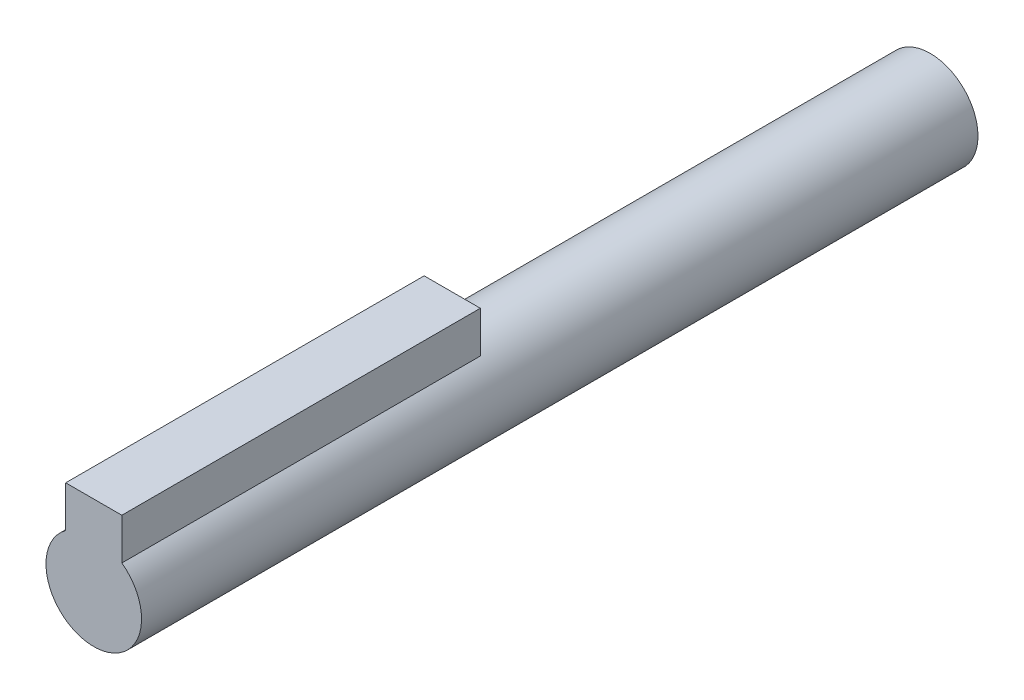
ISO-10303-21;
HEADER;
FILE_DESCRIPTION(('STEP AP214'),'2;1');
FILE_NAME('part.step','',(''),(''),'','','');
FILE_SCHEMA(('AUTOMOTIVE_DESIGN { 1 0 10303 214 1 1 1 1 }'));
ENDSEC;
DATA;
#1=APPLICATION_CONTEXT('core data for automotive mechanical design processes');
#2=APPLICATION_PROTOCOL_DEFINITION('international standard','automotive_design',2000,#1);
#3=PRODUCT_CONTEXT('',#1,'mechanical');
#4=PRODUCT('Part','Part','',(#3));
#5=PRODUCT_RELATED_PRODUCT_CATEGORY('part','',(#4));
#6=PRODUCT_DEFINITION_FORMATION('','',#4);
#7=PRODUCT_DEFINITION_CONTEXT('part definition',#1,'design');
#8=PRODUCT_DEFINITION('design','',#6,#7);
#9=PRODUCT_DEFINITION_SHAPE('','',#8);
#10=(LENGTH_UNIT() NAMED_UNIT(*) SI_UNIT(.MILLI.,.METRE.));
#11=(NAMED_UNIT(*) PLANE_ANGLE_UNIT() SI_UNIT($,.RADIAN.));
#12=(NAMED_UNIT(*) SI_UNIT($,.STERADIAN.) SOLID_ANGLE_UNIT());
#13=UNCERTAINTY_MEASURE_WITH_UNIT(LENGTH_MEASURE(1.E-05),#10,'distance_accuracy_value','');
#14=(GEOMETRIC_REPRESENTATION_CONTEXT(3) GLOBAL_UNCERTAINTY_ASSIGNED_CONTEXT((#13)) GLOBAL_UNIT_ASSIGNED_CONTEXT((#10,
#11,#12)) REPRESENTATION_CONTEXT('',''));
#15=CARTESIAN_POINT('',(0.,0.,0.));
#16=DIRECTION('',(0.,0.,1.));
#17=DIRECTION('',(1.,0.,0.));
#18=AXIS2_PLACEMENT_3D('',#15,#16,#17);
#19=CARTESIAN_POINT('',(0.,0.,70.));
#20=DIRECTION('',(0.,0.,-1.));
#21=DIRECTION('',(-1.,0.,0.));
#22=AXIS2_PLACEMENT_3D('',#19,#20,#21);
#23=CYLINDRICAL_SURFACE('',#22,4.);
#24=CARTESIAN_POINT('',(0.,0.,40.));
#25=DIRECTION('',(0.,0.,-1.));
#26=DIRECTION('',(-1.,0.,0.));
#27=AXIS2_PLACEMENT_3D('',#24,#25,#26);
#28=CIRCLE('',#27,4.);
#29=CARTESIAN_POINT('',(-2.35,3.2368966619279,40.));
#30=VERTEX_POINT('',#29);
#31=CARTESIAN_POINT('',(2.35,3.2368966619279,40.));
#32=VERTEX_POINT('',#31);
#33=EDGE_CURVE('E11',#30,#32,#28,.T.);
#34=ORIENTED_EDGE('',*,*,#33,.T.);
#35=DIRECTION('',(0.,0.,-1.));
#36=VECTOR('',#35,1.);
#37=CARTESIAN_POINT('',(2.35,3.2368966619279,70.));
#38=LINE('',#37,#36);
#39=CARTESIAN_POINT('',(2.35,3.2368966619279,70.));
#40=VERTEX_POINT('',#39);
#41=EDGE_CURVE('E54',#32,#40,#38,.F.);
#42=ORIENTED_EDGE('',*,*,#41,.T.);
#43=CARTESIAN_POINT('',(0.,0.,70.));
#44=DIRECTION('',(0.,0.,1.));
#45=DIRECTION('',(1.,0.,0.));
#46=AXIS2_PLACEMENT_3D('',#43,#44,#45);
#47=CIRCLE('',#46,4.);
#48=CARTESIAN_POINT('',(-2.35,3.2368966619279,70.));
#49=VERTEX_POINT('',#48);
#50=EDGE_CURVE('E39',#49,#40,#47,.T.);
#51=ORIENTED_EDGE('',*,*,#50,.F.);
#52=DIRECTION('',(0.,0.,-1.));
#53=VECTOR('',#52,1.);
#54=CARTESIAN_POINT('',(-2.35,3.2368966619279,70.));
#55=LINE('',#54,#53);
#56=EDGE_CURVE('E98',#49,#30,#55,.T.);
#57=ORIENTED_EDGE('',*,*,#56,.T.);
#58=EDGE_LOOP('',(#34,#42,#51,#57));
#59=FACE_BOUND('',#58,.T.);
#60=CARTESIAN_POINT('',(0.,0.,0.));
#61=DIRECTION('',(0.,0.,1.));
#62=DIRECTION('',(1.,0.,0.));
#63=AXIS2_PLACEMENT_3D('',#60,#61,#62);
#64=CIRCLE('',#63,4.);
#65=CARTESIAN_POINT('',(4.,0.,0.));
#66=VERTEX_POINT('',#65);
#67=EDGE_CURVE('E103',#66,#66,#64,.T.);
#68=ORIENTED_EDGE('',*,*,#67,.T.);
#69=EDGE_LOOP('',(#68));
#70=FACE_BOUND('',#69,.T.);
#71=ADVANCED_FACE('F32',(#59,#70),#23,.T.);
#72=CARTESIAN_POINT('',(0.,0.,70.));
#73=DIRECTION('',(0.,0.,1.));
#74=DIRECTION('',(1.,0.,0.));
#75=AXIS2_PLACEMENT_3D('',#72,#73,#74);
#76=PLANE('',#75);
#77=ORIENTED_EDGE('',*,*,#50,.T.);
#78=DIRECTION('',(0.,1.,0.));
#79=VECTOR('',#78,1.);
#80=CARTESIAN_POINT('',(2.35,1.3,70.));
#81=LINE('',#80,#79);
#82=CARTESIAN_POINT('',(2.35,6.7,70.));
#83=VERTEX_POINT('',#82);
#84=EDGE_CURVE('E94',#40,#83,#81,.T.);
#85=ORIENTED_EDGE('',*,*,#84,.T.);
#86=DIRECTION('',(-1.,0.,0.));
#87=VECTOR('',#86,1.);
#88=CARTESIAN_POINT('',(-2.35,6.7,70.));
#89=LINE('',#88,#87);
#90=CARTESIAN_POINT('',(-2.35,6.7,70.));
#91=VERTEX_POINT('',#90);
#92=EDGE_CURVE('E84',#83,#91,#89,.T.);
#93=ORIENTED_EDGE('',*,*,#92,.T.);
#94=DIRECTION('',(0.,-1.,0.));
#95=VECTOR('',#94,1.);
#96=CARTESIAN_POINT('',(-2.35,1.3,70.));
#97=LINE('',#96,#95);
#98=EDGE_CURVE('E46',#91,#49,#97,.T.);
#99=ORIENTED_EDGE('',*,*,#98,.T.);
#100=EDGE_LOOP('',(#77,#85,#93,#99));
#101=FACE_BOUND('',#100,.T.);
#102=ADVANCED_FACE('F110',(#101),#76,.T.);
#103=CARTESIAN_POINT('',(0.,0.,0.));
#104=DIRECTION('',(0.,0.,1.));
#105=DIRECTION('',(1.,0.,0.));
#106=AXIS2_PLACEMENT_3D('',#103,#104,#105);
#107=PLANE('',#106);
#108=ORIENTED_EDGE('',*,*,#67,.F.);
#109=EDGE_LOOP('',(#108));
#110=FACE_BOUND('',#109,.T.);
#111=ADVANCED_FACE('F108',(#110),#107,.F.);
#112=CARTESIAN_POINT('',(0.,0.,40.));
#113=DIRECTION('',(0.,0.,-1.));
#114=DIRECTION('',(-1.,0.,0.));
#115=AXIS2_PLACEMENT_3D('',#112,#113,#114);
#116=PLANE('',#115);
#117=ORIENTED_EDGE('',*,*,#33,.F.);
#118=DIRECTION('',(0.,-1.,0.));
#119=VECTOR('',#118,1.);
#120=CARTESIAN_POINT('',(-2.35,1.3,40.));
#121=LINE('',#120,#119);
#122=CARTESIAN_POINT('',(-2.35,6.7,40.));
#123=VERTEX_POINT('',#122);
#124=EDGE_CURVE('E86',#123,#30,#121,.T.);
#125=ORIENTED_EDGE('',*,*,#124,.F.);
#126=DIRECTION('',(-1.,0.,0.));
#127=VECTOR('',#126,1.);
#128=CARTESIAN_POINT('',(-2.35,6.7,40.));
#129=LINE('',#128,#127);
#130=CARTESIAN_POINT('',(2.35,6.7,40.));
#131=VERTEX_POINT('',#130);
#132=EDGE_CURVE('E79',#131,#123,#129,.T.);
#133=ORIENTED_EDGE('',*,*,#132,.F.);
#134=DIRECTION('',(0.,1.,0.));
#135=VECTOR('',#134,1.);
#136=CARTESIAN_POINT('',(2.35,1.3,40.));
#137=LINE('',#136,#135);
#138=EDGE_CURVE('E72',#32,#131,#137,.T.);
#139=ORIENTED_EDGE('',*,*,#138,.F.);
#140=EDGE_LOOP('',(#117,#125,#133,#139));
#141=FACE_BOUND('',#140,.T.);
#142=ADVANCED_FACE('F89',(#141),#116,.T.);
#143=CARTESIAN_POINT('',(2.35,1.3,40.));
#144=DIRECTION('',(1.,0.,0.));
#145=DIRECTION('',(0.,0.,-1.));
#146=AXIS2_PLACEMENT_3D('',#143,#144,#145);
#147=PLANE('',#146);
#148=ORIENTED_EDGE('',*,*,#41,.F.);
#149=ORIENTED_EDGE('',*,*,#138,.T.);
#150=DIRECTION('',(0.,0.,1.));
#151=VECTOR('',#150,1.);
#152=CARTESIAN_POINT('',(2.35,6.7,40.));
#153=LINE('',#152,#151);
#154=EDGE_CURVE('E75',#131,#83,#153,.T.);
#155=ORIENTED_EDGE('',*,*,#154,.T.);
#156=ORIENTED_EDGE('',*,*,#84,.F.);
#157=EDGE_LOOP('',(#148,#149,#155,#156));
#158=FACE_BOUND('',#157,.T.);
#159=ADVANCED_FACE('F74',(#158),#147,.T.);
#160=CARTESIAN_POINT('',(-2.35,1.3,40.));
#161=DIRECTION('',(-1.,0.,0.));
#162=DIRECTION('',(0.,0.,1.));
#163=AXIS2_PLACEMENT_3D('',#160,#161,#162);
#164=PLANE('',#163);
#165=ORIENTED_EDGE('',*,*,#56,.F.);
#166=ORIENTED_EDGE('',*,*,#98,.F.);
#167=DIRECTION('',(0.,0.,1.));
#168=VECTOR('',#167,1.);
#169=CARTESIAN_POINT('',(-2.35,6.7,40.));
#170=LINE('',#169,#168);
#171=EDGE_CURVE('E85',#123,#91,#170,.T.);
#172=ORIENTED_EDGE('',*,*,#171,.F.);
#173=ORIENTED_EDGE('',*,*,#124,.T.);
#174=EDGE_LOOP('',(#165,#166,#172,#173));
#175=FACE_BOUND('',#174,.T.);
#176=ADVANCED_FACE('F123',(#175),#164,.T.);
#177=CARTESIAN_POINT('',(-2.35,6.7,40.));
#178=DIRECTION('',(0.,1.,0.));
#179=DIRECTION('',(0.,0.,1.));
#180=AXIS2_PLACEMENT_3D('',#177,#178,#179);
#181=PLANE('',#180);
#182=ORIENTED_EDGE('',*,*,#92,.F.);
#183=ORIENTED_EDGE('',*,*,#154,.F.);
#184=ORIENTED_EDGE('',*,*,#132,.T.);
#185=ORIENTED_EDGE('',*,*,#171,.T.);
#186=EDGE_LOOP('',(#182,#183,#184,#185));
#187=FACE_BOUND('',#186,.T.);
#188=ADVANCED_FACE('F83',(#187),#181,.T.);
#189=CLOSED_SHELL('',(#71,#102,#111,#142,#159,#176,#188));
#190=MANIFOLD_SOLID_BREP('B2',#189);
#191=ADVANCED_BREP_SHAPE_REPRESENTATION('',(#18,#190),#14);
#192=SHAPE_DEFINITION_REPRESENTATION(#9,#191);
ENDSEC;
END-ISO-10303-21;
